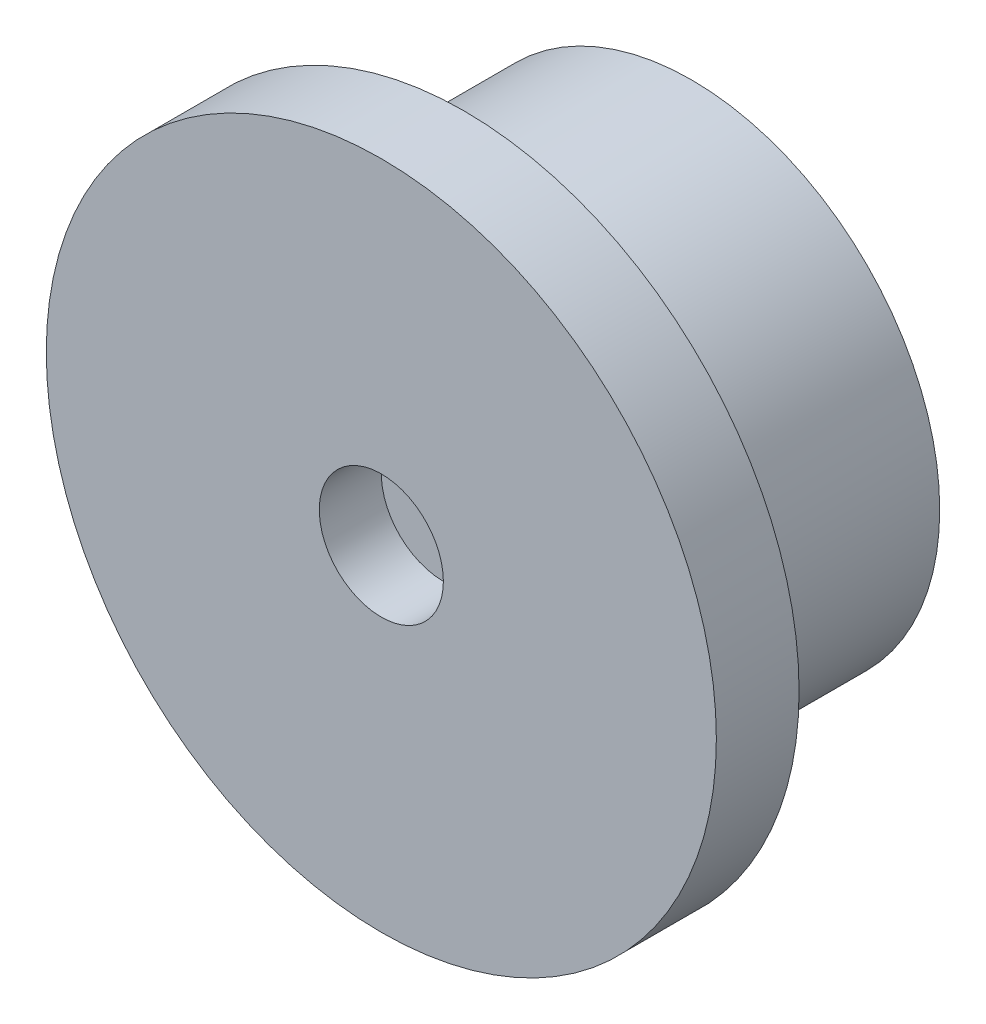
ISO-10303-21;
HEADER;
FILE_DESCRIPTION(('STEP AP214'),'2;1');
FILE_NAME('part.step','',(''),(''),'','','');
FILE_SCHEMA(('AUTOMOTIVE_DESIGN { 1 0 10303 214 1 1 1 1 }'));
ENDSEC;
DATA;
#1=APPLICATION_CONTEXT('core data for automotive mechanical design processes');
#2=APPLICATION_PROTOCOL_DEFINITION('international standard','automotive_design',2000,#1);
#3=PRODUCT_CONTEXT('',#1,'mechanical');
#4=PRODUCT('Part','Part','',(#3));
#5=PRODUCT_RELATED_PRODUCT_CATEGORY('part','',(#4));
#6=PRODUCT_DEFINITION_FORMATION('','',#4);
#7=PRODUCT_DEFINITION_CONTEXT('part definition',#1,'design');
#8=PRODUCT_DEFINITION('design','',#6,#7);
#9=PRODUCT_DEFINITION_SHAPE('','',#8);
#10=(LENGTH_UNIT() NAMED_UNIT(*) SI_UNIT(.MILLI.,.METRE.));
#11=(NAMED_UNIT(*) PLANE_ANGLE_UNIT() SI_UNIT($,.RADIAN.));
#12=(NAMED_UNIT(*) SI_UNIT($,.STERADIAN.) SOLID_ANGLE_UNIT());
#13=UNCERTAINTY_MEASURE_WITH_UNIT(LENGTH_MEASURE(1.E-05),#10,'distance_accuracy_value','');
#14=(GEOMETRIC_REPRESENTATION_CONTEXT(3) GLOBAL_UNCERTAINTY_ASSIGNED_CONTEXT((#13)) GLOBAL_UNIT_ASSIGNED_CONTEXT((#10,
#11,#12)) REPRESENTATION_CONTEXT('',''));
#15=CARTESIAN_POINT('',(0.,0.,0.));
#16=DIRECTION('',(0.,0.,1.));
#17=DIRECTION('',(1.,0.,0.));
#18=AXIS2_PLACEMENT_3D('',#15,#16,#17);
#19=CARTESIAN_POINT('',(0.,-12.,0.));
#20=DIRECTION('',(0.,0.,1.));
#21=DIRECTION('',(1.,0.,0.));
#22=AXIS2_PLACEMENT_3D('',#19,#20,#21);
#23=CYLINDRICAL_SURFACE('',#22,1.1);
#24=CARTESIAN_POINT('',(0.,-12.,3.));
#25=DIRECTION('',(0.,0.,1.));
#26=DIRECTION('',(1.,0.,0.));
#27=AXIS2_PLACEMENT_3D('',#24,#25,#26);
#28=CIRCLE('',#27,1.1);
#29=CARTESIAN_POINT('',(1.1,-12.,3.));
#30=VERTEX_POINT('',#29);
#31=EDGE_CURVE('E56',#30,#30,#28,.T.);
#32=ORIENTED_EDGE('',*,*,#31,.F.);
#33=EDGE_LOOP('',(#32));
#34=FACE_BOUND('',#33,.T.);
#35=CARTESIAN_POINT('',(0.,-12.,12.));
#36=DIRECTION('',(0.,0.,1.));
#37=DIRECTION('',(1.,0.,0.));
#38=AXIS2_PLACEMENT_3D('',#35,#36,#37);
#39=CIRCLE('',#38,1.1);
#40=CARTESIAN_POINT('',(1.1,-12.,12.));
#41=VERTEX_POINT('',#40);
#42=EDGE_CURVE('E44',#41,#41,#39,.F.);
#43=ORIENTED_EDGE('',*,*,#42,.F.);
#44=EDGE_LOOP('',(#43));
#45=FACE_BOUND('',#44,.T.);
#46=ADVANCED_FACE('F39',(#34,#45),#23,.F.);
#47=CARTESIAN_POINT('',(0.,-12.,0.));
#48=DIRECTION('',(0.,0.,1.));
#49=DIRECTION('',(1.,0.,0.));
#50=AXIS2_PLACEMENT_3D('',#47,#48,#49);
#51=PLANE('',#50);
#52=CARTESIAN_POINT('',(0.,-12.,0.));
#53=DIRECTION('',(0.,0.,1.));
#54=DIRECTION('',(1.,0.,0.));
#55=AXIS2_PLACEMENT_3D('',#52,#53,#54);
#56=CIRCLE('',#55,6.);
#57=CARTESIAN_POINT('',(6.,-12.,0.));
#58=VERTEX_POINT('',#57);
#59=EDGE_CURVE('E58',#58,#58,#56,.T.);
#60=ORIENTED_EDGE('',*,*,#59,.T.);
#61=EDGE_LOOP('',(#60));
#62=FACE_BOUND('',#61,.T.);
#63=CARTESIAN_POINT('',(0.,-12.,0.));
#64=DIRECTION('',(0.,0.,1.));
#65=DIRECTION('',(1.,0.,0.));
#66=AXIS2_PLACEMENT_3D('',#63,#64,#65);
#67=CIRCLE('',#66,12.);
#68=CARTESIAN_POINT('',(12.,-12.,0.));
#69=VERTEX_POINT('',#68);
#70=EDGE_CURVE('E53',#69,#69,#67,.T.);
#71=ORIENTED_EDGE('',*,*,#70,.F.);
#72=EDGE_LOOP('',(#71));
#73=FACE_BOUND('',#72,.T.);
#74=ADVANCED_FACE('F109',(#62,#73),#51,.F.);
#75=CARTESIAN_POINT('',(0.,-12.,48.9411254969543));
#76=DIRECTION('',(0.,0.,-1.));
#77=DIRECTION('',(-1.,0.,0.));
#78=AXIS2_PLACEMENT_3D('',#75,#76,#77);
#79=CYLINDRICAL_SURFACE('',#78,12.);
#80=CARTESIAN_POINT('',(0.,-12.,11.));
#81=DIRECTION('',(0.,0.,-1.));
#82=DIRECTION('',(-1.,0.,0.));
#83=AXIS2_PLACEMENT_3D('',#80,#81,#82);
#84=CIRCLE('',#83,12.);
#85=CARTESIAN_POINT('',(-12.,-12.,11.));
#86=VERTEX_POINT('',#85);
#87=EDGE_CURVE('E81',#86,#86,#84,.T.);
#88=ORIENTED_EDGE('',*,*,#87,.T.);
#89=EDGE_LOOP('',(#88));
#90=FACE_BOUND('',#89,.T.);
#91=ORIENTED_EDGE('',*,*,#70,.T.);
#92=EDGE_LOOP('',(#91));
#93=FACE_BOUND('',#92,.T.);
#94=ADVANCED_FACE('F86',(#90,#93),#79,.T.);
#95=CARTESIAN_POINT('',(0.,0.,11.));
#96=DIRECTION('',(0.,0.,-1.));
#97=DIRECTION('',(-1.,0.,0.));
#98=AXIS2_PLACEMENT_3D('',#95,#96,#97);
#99=PLANE('',#98);
#100=ORIENTED_EDGE('',*,*,#87,.F.);
#101=EDGE_LOOP('',(#100));
#102=FACE_BOUND('',#101,.T.);
#103=CARTESIAN_POINT('',(0.,-12.,11.));
#104=DIRECTION('',(0.,0.,-1.));
#105=DIRECTION('',(-1.,0.,0.));
#106=AXIS2_PLACEMENT_3D('',#103,#104,#105);
#107=CIRCLE('',#106,16.2);
#108=CARTESIAN_POINT('',(-16.2,-12.,11.));
#109=VERTEX_POINT('',#108);
#110=EDGE_CURVE('E78',#109,#109,#107,.F.);
#111=ORIENTED_EDGE('',*,*,#110,.F.);
#112=EDGE_LOOP('',(#111));
#113=FACE_BOUND('',#112,.T.);
#114=ADVANCED_FACE('F89',(#102,#113),#99,.T.);
#115=CARTESIAN_POINT('',(0.,-12.,-34.8205194208883));
#116=DIRECTION('',(0.,0.,1.));
#117=DIRECTION('',(1.,0.,0.));
#118=AXIS2_PLACEMENT_3D('',#115,#116,#117);
#119=CYLINDRICAL_SURFACE('',#118,16.2);
#120=CARTESIAN_POINT('',(0.,-12.,15.));
#121=DIRECTION('',(0.,0.,1.));
#122=DIRECTION('',(1.,0.,0.));
#123=AXIS2_PLACEMENT_3D('',#120,#121,#122);
#124=CIRCLE('',#123,16.2);
#125=CARTESIAN_POINT('',(16.2,-12.,15.));
#126=VERTEX_POINT('',#125);
#127=EDGE_CURVE('E62',#126,#126,#124,.T.);
#128=ORIENTED_EDGE('',*,*,#127,.F.);
#129=EDGE_LOOP('',(#128));
#130=FACE_BOUND('',#129,.T.);
#131=ORIENTED_EDGE('',*,*,#110,.T.);
#132=EDGE_LOOP('',(#131));
#133=FACE_BOUND('',#132,.T.);
#134=ADVANCED_FACE('F92',(#130,#133),#119,.T.);
#135=CARTESIAN_POINT('',(0.,4.2,15.));
#136=DIRECTION('',(0.,0.,-1.));
#137=DIRECTION('',(-1.,0.,0.));
#138=AXIS2_PLACEMENT_3D('',#135,#136,#137);
#139=PLANE('',#138);
#140=CARTESIAN_POINT('',(0.,-12.,15.));
#141=DIRECTION('',(0.,0.,1.));
#142=DIRECTION('',(1.,0.,0.));
#143=AXIS2_PLACEMENT_3D('',#140,#141,#142);
#144=CIRCLE('',#143,3.);
#145=CARTESIAN_POINT('',(3.,-12.,15.));
#146=VERTEX_POINT('',#145);
#147=EDGE_CURVE('E69',#146,#146,#144,.T.);
#148=ORIENTED_EDGE('',*,*,#147,.F.);
#149=EDGE_LOOP('',(#148));
#150=FACE_BOUND('',#149,.T.);
#151=ORIENTED_EDGE('',*,*,#127,.T.);
#152=EDGE_LOOP('',(#151));
#153=FACE_BOUND('',#152,.T.);
#154=ADVANCED_FACE('F97',(#150,#153),#139,.F.);
#155=CARTESIAN_POINT('',(0.,-12.,3.));
#156=DIRECTION('',(0.,0.,-1.));
#157=DIRECTION('',(-1.,0.,0.));
#158=AXIS2_PLACEMENT_3D('',#155,#156,#157);
#159=CYLINDRICAL_SURFACE('',#158,6.);
#160=CARTESIAN_POINT('',(0.,-12.,0.401923788646653));
#161=DIRECTION('',(0.,0.,1.));
#162=DIRECTION('',(1.,0.,0.));
#163=AXIS2_PLACEMENT_3D('',#160,#161,#162);
#164=CIRCLE('',#163,6.);
#165=CARTESIAN_POINT('',(6.,-12.,0.401923788646653));
#166=VERTEX_POINT('',#165);
#167=EDGE_CURVE('E48',#166,#166,#164,.T.);
#168=ORIENTED_EDGE('',*,*,#167,.T.);
#169=EDGE_LOOP('',(#168));
#170=FACE_BOUND('',#169,.T.);
#171=ORIENTED_EDGE('',*,*,#59,.F.);
#172=EDGE_LOOP('',(#171));
#173=FACE_BOUND('',#172,.T.);
#174=ADVANCED_FACE('F103',(#170,#173),#159,.F.);
#175=CARTESIAN_POINT('',(0.,-12.,3.));
#176=DIRECTION('',(0.,0.,1.));
#177=DIRECTION('',(1.,0.,0.));
#178=AXIS2_PLACEMENT_3D('',#175,#176,#177);
#179=PLANE('',#178);
#180=ORIENTED_EDGE('',*,*,#31,.T.);
#181=EDGE_LOOP('',(#180));
#182=FACE_BOUND('',#181,.T.);
#183=CARTESIAN_POINT('',(0.,-12.,3.));
#184=DIRECTION('',(0.,0.,1.));
#185=DIRECTION('',(1.,0.,0.));
#186=AXIS2_PLACEMENT_3D('',#183,#184,#185);
#187=CIRCLE('',#186,4.5);
#188=CARTESIAN_POINT('',(4.5,-12.,3.));
#189=VERTEX_POINT('',#188);
#190=EDGE_CURVE('E11',#189,#189,#187,.F.);
#191=ORIENTED_EDGE('',*,*,#190,.T.);
#192=EDGE_LOOP('',(#191));
#193=FACE_BOUND('',#192,.T.);
#194=ADVANCED_FACE('F122',(#182,#193),#179,.F.);
#195=CARTESIAN_POINT('',(0.,-12.,0.401923788646653));
#196=DIRECTION('',(0.,0.,-1.));
#197=DIRECTION('',(-1.,0.,0.));
#198=AXIS2_PLACEMENT_3D('',#195,#196,#197);
#199=CONICAL_SURFACE('',#198,6.,0.523598775598293);
#200=ORIENTED_EDGE('',*,*,#190,.F.);
#201=EDGE_LOOP('',(#200));
#202=FACE_BOUND('',#201,.T.);
#203=ORIENTED_EDGE('',*,*,#167,.F.);
#204=EDGE_LOOP('',(#203));
#205=FACE_BOUND('',#204,.T.);
#206=ADVANCED_FACE('F42',(#202,#205),#199,.F.);
#207=CARTESIAN_POINT('',(0.,-12.,12.));
#208=DIRECTION('',(0.,0.,1.));
#209=DIRECTION('',(1.,0.,0.));
#210=AXIS2_PLACEMENT_3D('',#207,#208,#209);
#211=PLANE('',#210);
#212=CARTESIAN_POINT('',(0.,-12.,12.));
#213=DIRECTION('',(0.,0.,1.));
#214=DIRECTION('',(1.,0.,0.));
#215=AXIS2_PLACEMENT_3D('',#212,#213,#214);
#216=CIRCLE('',#215,3.);
#217=CARTESIAN_POINT('',(3.,-12.,12.));
#218=VERTEX_POINT('',#217);
#219=EDGE_CURVE('E65',#218,#218,#216,.F.);
#220=ORIENTED_EDGE('',*,*,#219,.F.);
#221=EDGE_LOOP('',(#220));
#222=FACE_BOUND('',#221,.T.);
#223=ORIENTED_EDGE('',*,*,#42,.T.);
#224=EDGE_LOOP('',(#223));
#225=FACE_BOUND('',#224,.T.);
#226=ADVANCED_FACE('F170',(#222,#225),#211,.T.);
#227=CARTESIAN_POINT('',(0.,-12.,-5.48528137423857));
#228=DIRECTION('',(0.,0.,1.));
#229=DIRECTION('',(1.,0.,0.));
#230=AXIS2_PLACEMENT_3D('',#227,#228,#229);
#231=CYLINDRICAL_SURFACE('',#230,3.);
#232=ORIENTED_EDGE('',*,*,#219,.T.);
#233=EDGE_LOOP('',(#232));
#234=FACE_BOUND('',#233,.T.);
#235=ORIENTED_EDGE('',*,*,#147,.T.);
#236=EDGE_LOOP('',(#235));
#237=FACE_BOUND('',#236,.T.);
#238=ADVANCED_FACE('F120',(#234,#237),#231,.F.);
#239=CLOSED_SHELL('',(#46,#74,#94,#114,#134,#154,#174,#194,#206,#226,#238));
#240=MANIFOLD_SOLID_BREP('B2',#239);
#241=ADVANCED_BREP_SHAPE_REPRESENTATION('',(#18,#240),#14);
#242=SHAPE_DEFINITION_REPRESENTATION(#9,#241);
ENDSEC;
END-ISO-10303-21;
